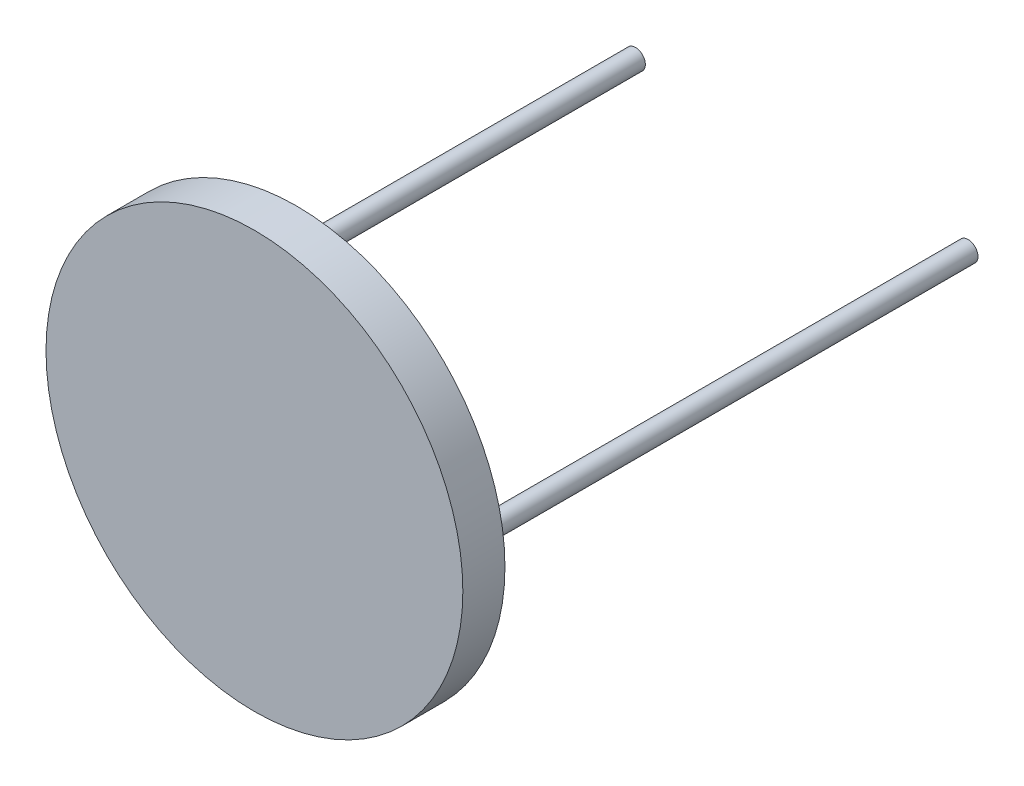
ISO-10303-21;
HEADER;
FILE_DESCRIPTION(('STEP AP214'),'2;1');
FILE_NAME('part.step','',(''),(''),'','','');
FILE_SCHEMA(('AUTOMOTIVE_DESIGN { 1 0 10303 214 1 1 1 1 }'));
ENDSEC;
DATA;
#1=APPLICATION_CONTEXT('core data for automotive mechanical design processes');
#2=APPLICATION_PROTOCOL_DEFINITION('international standard','automotive_design',2000,#1);
#3=PRODUCT_CONTEXT('',#1,'mechanical');
#4=PRODUCT('Part','Part','',(#3));
#5=PRODUCT_RELATED_PRODUCT_CATEGORY('part','',(#4));
#6=PRODUCT_DEFINITION_FORMATION('','',#4);
#7=PRODUCT_DEFINITION_CONTEXT('part definition',#1,'design');
#8=PRODUCT_DEFINITION('design','',#6,#7);
#9=PRODUCT_DEFINITION_SHAPE('','',#8);
#10=(LENGTH_UNIT() NAMED_UNIT(*) SI_UNIT(.MILLI.,.METRE.));
#11=(NAMED_UNIT(*) PLANE_ANGLE_UNIT() SI_UNIT($,.RADIAN.));
#12=(NAMED_UNIT(*) SI_UNIT($,.STERADIAN.) SOLID_ANGLE_UNIT());
#13=UNCERTAINTY_MEASURE_WITH_UNIT(LENGTH_MEASURE(1.E-05),#10,'distance_accuracy_value','');
#14=(GEOMETRIC_REPRESENTATION_CONTEXT(3) GLOBAL_UNCERTAINTY_ASSIGNED_CONTEXT((#13)) GLOBAL_UNIT_ASSIGNED_CONTEXT((#10,
#11,#12)) REPRESENTATION_CONTEXT('',''));
#15=CARTESIAN_POINT('',(0.,0.,0.));
#16=DIRECTION('',(0.,0.,1.));
#17=DIRECTION('',(1.,0.,0.));
#18=AXIS2_PLACEMENT_3D('',#15,#16,#17);
#19=CARTESIAN_POINT('',(0.,0.,2.));
#20=DIRECTION('',(0.,0.,-1.));
#21=DIRECTION('',(-1.,0.,0.));
#22=AXIS2_PLACEMENT_3D('',#19,#20,#21);
#23=CYLINDRICAL_SURFACE('',#22,9.9);
#24=CARTESIAN_POINT('',(0.,0.,2.));
#25=DIRECTION('',(0.,0.,1.));
#26=DIRECTION('',(1.,0.,0.));
#27=AXIS2_PLACEMENT_3D('',#24,#25,#26);
#28=CIRCLE('',#27,9.9);
#29=CARTESIAN_POINT('',(9.9,0.,2.));
#30=VERTEX_POINT('',#29);
#31=EDGE_CURVE('E46',#30,#30,#28,.T.);
#32=ORIENTED_EDGE('',*,*,#31,.F.);
#33=EDGE_LOOP('',(#32));
#34=FACE_BOUND('',#33,.T.);
#35=CARTESIAN_POINT('',(0.,0.,0.));
#36=DIRECTION('',(0.,0.,1.));
#37=DIRECTION('',(1.,0.,0.));
#38=AXIS2_PLACEMENT_3D('',#35,#36,#37);
#39=CIRCLE('',#38,9.9);
#40=CARTESIAN_POINT('',(9.9,0.,0.));
#41=VERTEX_POINT('',#40);
#42=EDGE_CURVE('E50',#41,#41,#39,.T.);
#43=ORIENTED_EDGE('',*,*,#42,.T.);
#44=EDGE_LOOP('',(#43));
#45=FACE_BOUND('',#44,.T.);
#46=ADVANCED_FACE('F36',(#34,#45),#23,.T.);
#47=CARTESIAN_POINT('',(0.,0.,2.));
#48=DIRECTION('',(0.,0.,1.));
#49=DIRECTION('',(1.,0.,0.));
#50=AXIS2_PLACEMENT_3D('',#47,#48,#49);
#51=PLANE('',#50);
#52=ORIENTED_EDGE('',*,*,#31,.T.);
#53=EDGE_LOOP('',(#52));
#54=FACE_BOUND('',#53,.T.);
#55=ADVANCED_FACE('F77',(#54),#51,.T.);
#56=CARTESIAN_POINT('',(0.,0.,0.));
#57=DIRECTION('',(0.,0.,1.));
#58=DIRECTION('',(1.,0.,0.));
#59=AXIS2_PLACEMENT_3D('',#56,#57,#58);
#60=PLANE('',#59);
#61=CARTESIAN_POINT('',(-7.9,0.,0.));
#62=DIRECTION('',(0.,0.,1.));
#63=DIRECTION('',(1.,0.,0.));
#64=AXIS2_PLACEMENT_3D('',#61,#62,#63);
#65=CIRCLE('',#64,0.47);
#66=CARTESIAN_POINT('',(-7.43,0.,0.));
#67=VERTEX_POINT('',#66);
#68=EDGE_CURVE('E10',#67,#67,#65,.F.);
#69=ORIENTED_EDGE('',*,*,#68,.F.);
#70=EDGE_LOOP('',(#69));
#71=FACE_BOUND('',#70,.T.);
#72=CARTESIAN_POINT('',(7.9,0.,0.));
#73=DIRECTION('',(0.,0.,1.));
#74=DIRECTION('',(1.,0.,0.));
#75=AXIS2_PLACEMENT_3D('',#72,#73,#74);
#76=CIRCLE('',#75,0.47);
#77=CARTESIAN_POINT('',(8.37,0.,0.));
#78=VERTEX_POINT('',#77);
#79=EDGE_CURVE('E42',#78,#78,#76,.F.);
#80=ORIENTED_EDGE('',*,*,#79,.F.);
#81=EDGE_LOOP('',(#80));
#82=FACE_BOUND('',#81,.T.);
#83=ORIENTED_EDGE('',*,*,#42,.F.);
#84=EDGE_LOOP('',(#83));
#85=FACE_BOUND('',#84,.T.);
#86=ADVANCED_FACE('F82',(#71,#82,#85),#60,.F.);
#87=CARTESIAN_POINT('',(7.9,0.,-24.));
#88=DIRECTION('',(0.,0.,1.));
#89=DIRECTION('',(1.,0.,0.));
#90=AXIS2_PLACEMENT_3D('',#87,#88,#89);
#91=CYLINDRICAL_SURFACE('',#90,0.47);
#92=CARTESIAN_POINT('',(7.9,0.,-24.));
#93=DIRECTION('',(0.,0.,-1.));
#94=DIRECTION('',(-1.,0.,0.));
#95=AXIS2_PLACEMENT_3D('',#92,#93,#94);
#96=CIRCLE('',#95,0.47);
#97=CARTESIAN_POINT('',(7.43,0.,-24.));
#98=VERTEX_POINT('',#97);
#99=EDGE_CURVE('E54',#98,#98,#96,.T.);
#100=ORIENTED_EDGE('',*,*,#99,.F.);
#101=EDGE_LOOP('',(#100));
#102=FACE_BOUND('',#101,.T.);
#103=ORIENTED_EDGE('',*,*,#79,.T.);
#104=EDGE_LOOP('',(#103));
#105=FACE_BOUND('',#104,.T.);
#106=ADVANCED_FACE('F73',(#102,#105),#91,.T.);
#107=CARTESIAN_POINT('',(7.9,0.,-24.));
#108=DIRECTION('',(0.,0.,-1.));
#109=DIRECTION('',(-1.,0.,0.));
#110=AXIS2_PLACEMENT_3D('',#107,#108,#109);
#111=PLANE('',#110);
#112=ORIENTED_EDGE('',*,*,#99,.T.);
#113=EDGE_LOOP('',(#112));
#114=FACE_BOUND('',#113,.T.);
#115=ADVANCED_FACE('F66',(#114),#111,.T.);
#116=CARTESIAN_POINT('',(-7.9,0.,-24.));
#117=DIRECTION('',(0.,0.,1.));
#118=DIRECTION('',(1.,0.,0.));
#119=AXIS2_PLACEMENT_3D('',#116,#117,#118);
#120=CYLINDRICAL_SURFACE('',#119,0.47);
#121=CARTESIAN_POINT('',(-7.9,0.,-24.));
#122=DIRECTION('',(0.,0.,-1.));
#123=DIRECTION('',(-1.,0.,0.));
#124=AXIS2_PLACEMENT_3D('',#121,#122,#123);
#125=CIRCLE('',#124,0.47);
#126=CARTESIAN_POINT('',(-8.37,0.,-24.));
#127=VERTEX_POINT('',#126);
#128=EDGE_CURVE('E58',#127,#127,#125,.T.);
#129=ORIENTED_EDGE('',*,*,#128,.F.);
#130=EDGE_LOOP('',(#129));
#131=FACE_BOUND('',#130,.T.);
#132=ORIENTED_EDGE('',*,*,#68,.T.);
#133=EDGE_LOOP('',(#132));
#134=FACE_BOUND('',#133,.T.);
#135=ADVANCED_FACE('F64',(#131,#134),#120,.T.);
#136=CARTESIAN_POINT('',(-7.9,0.,-24.));
#137=DIRECTION('',(0.,0.,-1.));
#138=DIRECTION('',(-1.,0.,0.));
#139=AXIS2_PLACEMENT_3D('',#136,#137,#138);
#140=PLANE('',#139);
#141=ORIENTED_EDGE('',*,*,#128,.T.);
#142=EDGE_LOOP('',(#141));
#143=FACE_BOUND('',#142,.T.);
#144=ADVANCED_FACE('F62',(#143),#140,.T.);
#145=CLOSED_SHELL('',(#46,#55,#86,#106,#115,#135,#144));
#146=MANIFOLD_SOLID_BREP('B2',#145);
#147=ADVANCED_BREP_SHAPE_REPRESENTATION('',(#18,#146),#14);
#148=SHAPE_DEFINITION_REPRESENTATION(#9,#147);
ENDSEC;
END-ISO-10303-21;
